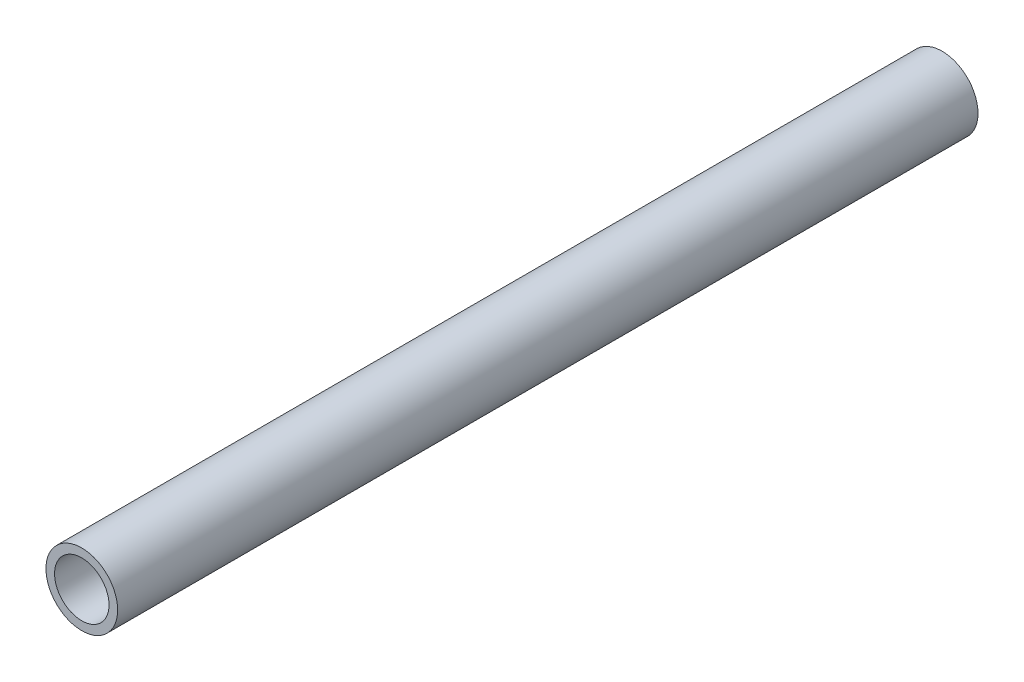
ISO-10303-21;
HEADER;
FILE_DESCRIPTION(('STEP AP214'),'2;1');
FILE_NAME('part.step','',(''),(''),'','','');
FILE_SCHEMA(('AUTOMOTIVE_DESIGN { 1 0 10303 214 1 1 1 1 }'));
ENDSEC;
DATA;
#1=APPLICATION_CONTEXT('core data for automotive mechanical design processes');
#2=APPLICATION_PROTOCOL_DEFINITION('international standard','automotive_design',2000,#1);
#3=PRODUCT_CONTEXT('',#1,'mechanical');
#4=PRODUCT('Part','Part','',(#3));
#5=PRODUCT_RELATED_PRODUCT_CATEGORY('part','',(#4));
#6=PRODUCT_DEFINITION_FORMATION('','',#4);
#7=PRODUCT_DEFINITION_CONTEXT('part definition',#1,'design');
#8=PRODUCT_DEFINITION('design','',#6,#7);
#9=PRODUCT_DEFINITION_SHAPE('','',#8);
#10=(LENGTH_UNIT() NAMED_UNIT(*) SI_UNIT(.MILLI.,.METRE.));
#11=(NAMED_UNIT(*) PLANE_ANGLE_UNIT() SI_UNIT($,.RADIAN.));
#12=(NAMED_UNIT(*) SI_UNIT($,.STERADIAN.) SOLID_ANGLE_UNIT());
#13=UNCERTAINTY_MEASURE_WITH_UNIT(LENGTH_MEASURE(1.E-05),#10,'distance_accuracy_value','');
#14=(GEOMETRIC_REPRESENTATION_CONTEXT(3) GLOBAL_UNCERTAINTY_ASSIGNED_CONTEXT((#13)) GLOBAL_UNIT_ASSIGNED_CONTEXT((#10,
#11,#12)) REPRESENTATION_CONTEXT('',''));
#15=CARTESIAN_POINT('',(0.,0.,0.));
#16=DIRECTION('',(0.,0.,1.));
#17=DIRECTION('',(1.,0.,0.));
#18=AXIS2_PLACEMENT_3D('',#15,#16,#17);
#19=CARTESIAN_POINT('',(0.,0.,300.));
#20=DIRECTION('',(0.,0.,1.));
#21=DIRECTION('',(1.,0.,0.));
#22=AXIS2_PLACEMENT_3D('',#19,#20,#21);
#23=PLANE('',#22);
#24=CARTESIAN_POINT('',(0.,0.,300.));
#25=DIRECTION('',(0.,0.,1.));
#26=DIRECTION('',(1.,0.,0.));
#27=AXIS2_PLACEMENT_3D('',#24,#25,#26);
#28=CIRCLE('',#27,12.5);
#29=CARTESIAN_POINT('',(12.5,0.,300.));
#30=VERTEX_POINT('',#29);
#31=EDGE_CURVE('E10',#30,#30,#28,.T.);
#32=ORIENTED_EDGE('',*,*,#31,.T.);
#33=EDGE_LOOP('',(#32));
#34=FACE_BOUND('',#33,.T.);
#35=CARTESIAN_POINT('',(0.,0.,300.));
#36=DIRECTION('',(0.,0.,1.));
#37=DIRECTION('',(1.,0.,0.));
#38=AXIS2_PLACEMENT_3D('',#35,#36,#37);
#39=CIRCLE('',#38,9.5);
#40=CARTESIAN_POINT('',(9.5,0.,300.));
#41=VERTEX_POINT('',#40);
#42=EDGE_CURVE('E44',#41,#41,#39,.T.);
#43=ORIENTED_EDGE('',*,*,#42,.F.);
#44=EDGE_LOOP('',(#43));
#45=FACE_BOUND('',#44,.T.);
#46=ADVANCED_FACE('F33',(#34,#45),#23,.T.);
#47=CARTESIAN_POINT('',(0.,0.,0.));
#48=DIRECTION('',(0.,0.,1.));
#49=DIRECTION('',(1.,0.,0.));
#50=AXIS2_PLACEMENT_3D('',#47,#48,#49);
#51=PLANE('',#50);
#52=CARTESIAN_POINT('',(0.,0.,0.));
#53=DIRECTION('',(0.,0.,1.));
#54=DIRECTION('',(1.,0.,0.));
#55=AXIS2_PLACEMENT_3D('',#52,#53,#54);
#56=CIRCLE('',#55,12.5);
#57=CARTESIAN_POINT('',(12.5,0.,0.));
#58=VERTEX_POINT('',#57);
#59=EDGE_CURVE('E37',#58,#58,#56,.T.);
#60=ORIENTED_EDGE('',*,*,#59,.F.);
#61=EDGE_LOOP('',(#60));
#62=FACE_BOUND('',#61,.T.);
#63=CARTESIAN_POINT('',(0.,0.,0.));
#64=DIRECTION('',(0.,0.,1.));
#65=DIRECTION('',(1.,0.,0.));
#66=AXIS2_PLACEMENT_3D('',#63,#64,#65);
#67=CIRCLE('',#66,9.5);
#68=CARTESIAN_POINT('',(9.5,0.,0.));
#69=VERTEX_POINT('',#68);
#70=EDGE_CURVE('E46',#69,#69,#67,.T.);
#71=ORIENTED_EDGE('',*,*,#70,.T.);
#72=EDGE_LOOP('',(#71));
#73=FACE_BOUND('',#72,.T.);
#74=ADVANCED_FACE('F56',(#62,#73),#51,.F.);
#75=CARTESIAN_POINT('',(0.,0.,300.));
#76=DIRECTION('',(0.,0.,-1.));
#77=DIRECTION('',(-1.,0.,0.));
#78=AXIS2_PLACEMENT_3D('',#75,#76,#77);
#79=CYLINDRICAL_SURFACE('',#78,12.5);
#80=ORIENTED_EDGE('',*,*,#31,.F.);
#81=EDGE_LOOP('',(#80));
#82=FACE_BOUND('',#81,.T.);
#83=ORIENTED_EDGE('',*,*,#59,.T.);
#84=EDGE_LOOP('',(#83));
#85=FACE_BOUND('',#84,.T.);
#86=ADVANCED_FACE('F35',(#82,#85),#79,.T.);
#87=CARTESIAN_POINT('',(0.,0.,300.));
#88=DIRECTION('',(0.,0.,-1.));
#89=DIRECTION('',(-1.,0.,0.));
#90=AXIS2_PLACEMENT_3D('',#87,#88,#89);
#91=CYLINDRICAL_SURFACE('',#90,9.5);
#92=ORIENTED_EDGE('',*,*,#42,.T.);
#93=EDGE_LOOP('',(#92));
#94=FACE_BOUND('',#93,.T.);
#95=ORIENTED_EDGE('',*,*,#70,.F.);
#96=EDGE_LOOP('',(#95));
#97=FACE_BOUND('',#96,.T.);
#98=ADVANCED_FACE('F52',(#94,#97),#91,.F.);
#99=CLOSED_SHELL('',(#46,#74,#86,#98));
#100=MANIFOLD_SOLID_BREP('B2',#99);
#101=ADVANCED_BREP_SHAPE_REPRESENTATION('',(#18,#100),#14);
#102=SHAPE_DEFINITION_REPRESENTATION(#9,#101);
ENDSEC;
END-ISO-10303-21;
